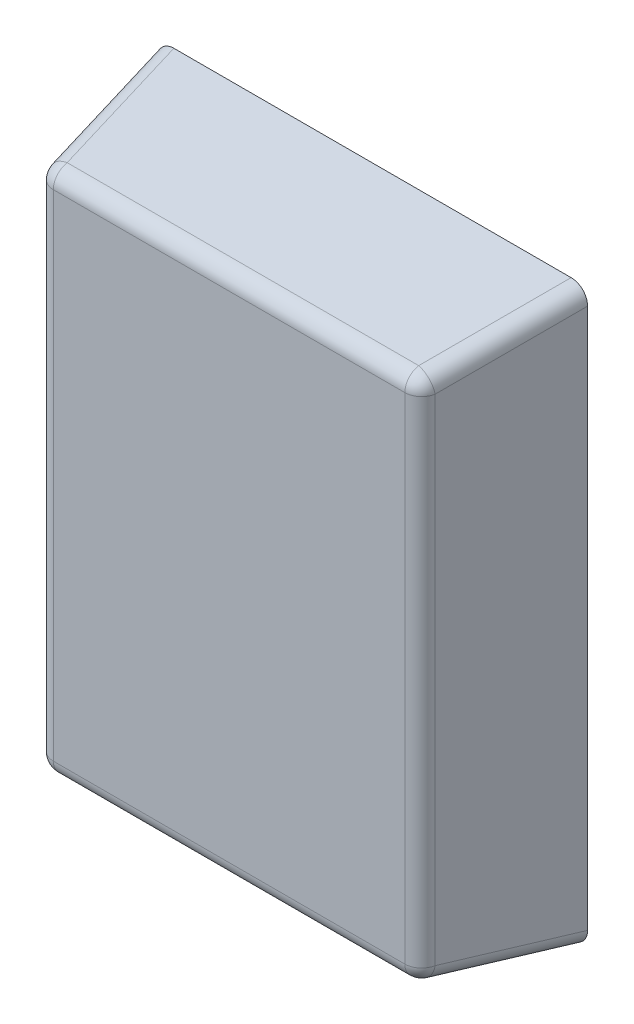
ISO-10303-21;
HEADER;
FILE_DESCRIPTION(('STEP AP214'),'2;1');
FILE_NAME('part.step','',(''),(''),'','','');
FILE_SCHEMA(('AUTOMOTIVE_DESIGN { 1 0 10303 214 1 1 1 1 }'));
ENDSEC;
DATA;
#1=APPLICATION_CONTEXT('core data for automotive mechanical design processes');
#2=APPLICATION_PROTOCOL_DEFINITION('international standard','automotive_design',2000,#1);
#3=PRODUCT_CONTEXT('',#1,'mechanical');
#4=PRODUCT('Part','Part','',(#3));
#5=PRODUCT_RELATED_PRODUCT_CATEGORY('part','',(#4));
#6=PRODUCT_DEFINITION_FORMATION('','',#4);
#7=PRODUCT_DEFINITION_CONTEXT('part definition',#1,'design');
#8=PRODUCT_DEFINITION('design','',#6,#7);
#9=PRODUCT_DEFINITION_SHAPE('','',#8);
#10=(LENGTH_UNIT() NAMED_UNIT(*) SI_UNIT(.MILLI.,.METRE.));
#11=(NAMED_UNIT(*) PLANE_ANGLE_UNIT() SI_UNIT($,.RADIAN.));
#12=(NAMED_UNIT(*) SI_UNIT($,.STERADIAN.) SOLID_ANGLE_UNIT());
#13=UNCERTAINTY_MEASURE_WITH_UNIT(LENGTH_MEASURE(1.E-05),#10,'distance_accuracy_value','');
#14=(GEOMETRIC_REPRESENTATION_CONTEXT(3) GLOBAL_UNCERTAINTY_ASSIGNED_CONTEXT((#13)) GLOBAL_UNIT_ASSIGNED_CONTEXT((#10,
#11,#12)) REPRESENTATION_CONTEXT('',''));
#15=CARTESIAN_POINT('',(0.,0.,0.));
#16=DIRECTION('',(0.,0.,1.));
#17=DIRECTION('',(1.,0.,0.));
#18=AXIS2_PLACEMENT_3D('',#15,#16,#17);
#19=CARTESIAN_POINT('',(-0.927464285309382,-0.641019643054923,0.245));
#20=DIRECTION('',(0.,0.,1.));
#21=DIRECTION('',(1.,0.,0.));
#22=AXIS2_PLACEMENT_3D('',#19,#20,#21);
#23=PLANE('',#22);
#24=DIRECTION('',(0.,1.,0.));
#25=VECTOR('',#24,1.);
#26=CARTESIAN_POINT('',(-0.853917601570131,-0.581022128259369,0.245));
#27=LINE('',#26,#25);
#28=CARTESIAN_POINT('',(-0.853917601570131,-0.537477929724562,0.245));
#29=VERTEX_POINT('',#28);
#30=CARTESIAN_POINT('',(-0.853917601570131,-0.744561356385284,0.245));
#31=VERTEX_POINT('',#30);
#32=EDGE_CURVE('E236',#29,#31,#27,.F.);
#33=ORIENTED_EDGE('',*,*,#32,.F.);
#34=DIRECTION('',(-1.,0.,0.));
#35=VECTOR('',#34,1.);
#36=CARTESIAN_POINT('',(-0.972464285309383,-0.537477929724562,0.245));
#37=LINE('',#36,#35);
#38=CARTESIAN_POINT('',(-1.00101096904863,-0.537477929724562,0.245));
#39=VERTEX_POINT('',#38);
#40=EDGE_CURVE('E224',#39,#29,#37,.F.);
#41=ORIENTED_EDGE('',*,*,#40,.F.);
#42=DIRECTION('',(0.,-1.,0.));
#43=VECTOR('',#42,1.);
#44=CARTESIAN_POINT('',(-1.00101096904863,-0.701017157850478,0.245));
#45=LINE('',#44,#43);
#46=CARTESIAN_POINT('',(-1.00101096904863,-0.744561356385284,0.245));
#47=VERTEX_POINT('',#46);
#48=EDGE_CURVE('E229',#47,#39,#45,.F.);
#49=ORIENTED_EDGE('',*,*,#48,.F.);
#50=DIRECTION('',(1.,0.,0.));
#51=VECTOR('',#50,1.);
#52=CARTESIAN_POINT('',(-0.882464285309382,-0.744561356385284,0.245));
#53=LINE('',#52,#51);
#54=EDGE_CURVE('E241',#31,#47,#53,.F.);
#55=ORIENTED_EDGE('',*,*,#54,.F.);
#56=EDGE_LOOP('',(#33,#41,#49,#55));
#57=FACE_BOUND('',#56,.T.);
#58=ADVANCED_FACE('F17',(#57),#23,.T.);
#59=CARTESIAN_POINT('',(-1.00101096904863,-0.701017157850478,0.238));
#60=DIRECTION('',(0.,-1.,0.));
#61=DIRECTION('',(1.,0.,0.));
#62=AXIS2_PLACEMENT_3D('',#59,#60,#61);
#63=CYLINDRICAL_SURFACE('',#62,0.007);
#64=DIRECTION('',(0.,1.,0.));
#65=VECTOR('',#64,1.);
#66=CARTESIAN_POINT('',(-1.00790462331972,-0.761014672646032,0.239215537243667));
#67=LINE('',#66,#65);
#68=CARTESIAN_POINT('',(-1.00790462331972,-0.744561356385283,0.239215537243667));
#69=VERTEX_POINT('',#68);
#70=CARTESIAN_POINT('',(-1.00790462331972,-0.537477929724562,0.239215537243668));
#71=VERTEX_POINT('',#70);
#72=EDGE_CURVE('E114',#69,#71,#67,.T.);
#73=ORIENTED_EDGE('',*,*,#72,.F.);
#74=CARTESIAN_POINT('',(-1.00101096904863,-0.744561356385283,0.238));
#75=DIRECTION('',(0.,-1.,-1.82015343698568E-13));
#76=DIRECTION('',(1.,0.,0.));
#77=AXIS2_PLACEMENT_3D('',#74,#75,#76);
#78=CIRCLE('',#77,0.007);
#79=EDGE_CURVE('E221',#47,#69,#78,.T.);
#80=ORIENTED_EDGE('',*,*,#79,.F.);
#81=ORIENTED_EDGE('',*,*,#48,.T.);
#82=CARTESIAN_POINT('',(-1.00101096904863,-0.537477929724562,0.238));
#83=DIRECTION('',(0.,-1.,0.));
#84=DIRECTION('',(1.,0.,0.));
#85=AXIS2_PLACEMENT_3D('',#82,#83,#84);
#86=CIRCLE('',#85,0.007);
#87=EDGE_CURVE('E74',#71,#39,#86,.F.);
#88=ORIENTED_EDGE('',*,*,#87,.F.);
#89=EDGE_LOOP('',(#73,#80,#81,#88));
#90=FACE_BOUND('',#89,.T.);
#91=ADVANCED_FACE('F214',(#90),#63,.T.);
#92=CARTESIAN_POINT('',(-1.00101096904863,-0.744561356385283,0.238));
#93=DIRECTION('',(1.,0.,0.));
#94=DIRECTION('',(0.,1.,0.));
#95=AXIS2_PLACEMENT_3D('',#92,#93,#94);
#96=SPHERICAL_SURFACE('',#95,0.007);
#97=ORIENTED_EDGE('',*,*,#79,.T.);
#98=CARTESIAN_POINT('',(-1.00101096904863,-0.744561356385283,0.238));
#99=DIRECTION('',(-0.171087869746035,-0.171087869746037,-0.970287525247814));
#100=DIRECTION('',(0.,0.984807753012208,-0.173648177666932));
#101=AXIS2_PLACEMENT_3D('',#98,#99,#100);
#102=CIRCLE('',#101,0.007);
#103=CARTESIAN_POINT('',(-1.00101096904863,-0.751455010656369,0.239215537243669));
#104=VERTEX_POINT('',#103);
#105=EDGE_CURVE('E20',#104,#69,#102,.T.);
#106=ORIENTED_EDGE('',*,*,#105,.F.);
#107=CARTESIAN_POINT('',(-1.00101096904863,-0.744561356385284,0.238));
#108=DIRECTION('',(1.,0.,0.));
#109=DIRECTION('',(0.,1.,0.));
#110=AXIS2_PLACEMENT_3D('',#107,#108,#109);
#111=CIRCLE('',#110,0.007);
#112=EDGE_CURVE('E223',#47,#104,#111,.T.);
#113=ORIENTED_EDGE('',*,*,#112,.F.);
#114=EDGE_LOOP('',(#97,#106,#113));
#115=FACE_BOUND('',#114,.T.);
#116=ADVANCED_FACE('F210',(#115),#96,.T.);
#117=CARTESIAN_POINT('',(-0.882464285309382,-0.744561356385284,0.238));
#118=DIRECTION('',(1.,0.,0.));
#119=DIRECTION('',(0.,1.,0.));
#120=AXIS2_PLACEMENT_3D('',#117,#118,#119);
#121=CYLINDRICAL_SURFACE('',#120,0.007);
#122=DIRECTION('',(1.,0.,0.));
#123=VECTOR('',#122,1.);
#124=CARTESIAN_POINT('',(-0.837464285309383,-0.75145501065637,0.239215537243668));
#125=LINE('',#124,#123);
#126=CARTESIAN_POINT('',(-0.853917601570131,-0.751455010656369,0.239215537243668));
#127=VERTEX_POINT('',#126);
#128=EDGE_CURVE('E146',#127,#104,#125,.F.);
#129=ORIENTED_EDGE('',*,*,#128,.F.);
#130=CARTESIAN_POINT('',(-0.853917601570131,-0.744561356385284,0.238));
#131=DIRECTION('',(1.,0.,0.));
#132=DIRECTION('',(0.,1.,0.));
#133=AXIS2_PLACEMENT_3D('',#130,#131,#132);
#134=CIRCLE('',#133,0.00699999999999995);
#135=EDGE_CURVE('E198',#31,#127,#134,.T.);
#136=ORIENTED_EDGE('',*,*,#135,.F.);
#137=ORIENTED_EDGE('',*,*,#54,.T.);
#138=ORIENTED_EDGE('',*,*,#112,.T.);
#139=EDGE_LOOP('',(#129,#136,#137,#138));
#140=FACE_BOUND('',#139,.T.);
#141=ADVANCED_FACE('F206',(#140),#121,.T.);
#142=CARTESIAN_POINT('',(-0.853917601570132,-0.744561356385284,0.238));
#143=DIRECTION('',(1.,0.,0.));
#144=DIRECTION('',(0.,1.,0.));
#145=AXIS2_PLACEMENT_3D('',#142,#143,#144);
#146=SPHERICAL_SURFACE('',#145,0.007);
#147=ORIENTED_EDGE('',*,*,#135,.T.);
#148=CARTESIAN_POINT('',(-0.853917601570132,-0.744561356385283,0.237999999999999));
#149=DIRECTION('',(0.171087869746039,-0.171087869746042,-0.970287525247812));
#150=DIRECTION('',(0.,0.984807753012207,-0.173648177666937));
#151=AXIS2_PLACEMENT_3D('',#148,#149,#150);
#152=CIRCLE('',#151,0.007);
#153=CARTESIAN_POINT('',(-0.847023947299046,-0.744561356385284,0.239215537243668));
#154=VERTEX_POINT('',#153);
#155=EDGE_CURVE('E136',#154,#127,#152,.T.);
#156=ORIENTED_EDGE('',*,*,#155,.F.);
#157=CARTESIAN_POINT('',(-0.853917601570131,-0.744561356385284,0.238));
#158=DIRECTION('',(0.,1.,0.));
#159=DIRECTION('',(-1.,0.,0.));
#160=AXIS2_PLACEMENT_3D('',#157,#158,#159);
#161=CIRCLE('',#160,0.007);
#162=EDGE_CURVE('E194',#31,#154,#161,.T.);
#163=ORIENTED_EDGE('',*,*,#162,.F.);
#164=EDGE_LOOP('',(#147,#156,#163));
#165=FACE_BOUND('',#164,.T.);
#166=ADVANCED_FACE('F203',(#165),#146,.T.);
#167=CARTESIAN_POINT('',(-0.853917601570131,-0.581022128259369,0.238));
#168=DIRECTION('',(0.,1.,0.));
#169=DIRECTION('',(-1.,0.,0.));
#170=AXIS2_PLACEMENT_3D('',#167,#168,#169);
#171=CYLINDRICAL_SURFACE('',#170,0.007);
#172=DIRECTION('',(0.,1.,0.));
#173=VECTOR('',#172,1.);
#174=CARTESIAN_POINT('',(-0.847023947299045,-0.521024613463814,0.239215537243668));
#175=LINE('',#174,#173);
#176=CARTESIAN_POINT('',(-0.847023947299046,-0.537477929724562,0.239215537243668));
#177=VERTEX_POINT('',#176);
#178=EDGE_CURVE('E137',#177,#154,#175,.F.);
#179=ORIENTED_EDGE('',*,*,#178,.F.);
#180=CARTESIAN_POINT('',(-0.853917601570131,-0.537477929724562,0.238));
#181=DIRECTION('',(0.,-1.,0.));
#182=DIRECTION('',(1.,0.,0.));
#183=AXIS2_PLACEMENT_3D('',#180,#181,#182);
#184=CIRCLE('',#183,0.007);
#185=EDGE_CURVE('E190',#29,#177,#184,.F.);
#186=ORIENTED_EDGE('',*,*,#185,.F.);
#187=ORIENTED_EDGE('',*,*,#32,.T.);
#188=ORIENTED_EDGE('',*,*,#162,.T.);
#189=EDGE_LOOP('',(#179,#186,#187,#188));
#190=FACE_BOUND('',#189,.T.);
#191=ADVANCED_FACE('F182',(#190),#171,.T.);
#192=CARTESIAN_POINT('',(-0.853917601570131,-0.537477929724562,0.238));
#193=DIRECTION('',(1.,0.,0.));
#194=DIRECTION('',(0.,1.,0.));
#195=AXIS2_PLACEMENT_3D('',#192,#193,#194);
#196=SPHERICAL_SURFACE('',#195,0.007);
#197=CARTESIAN_POINT('',(-0.853917601570131,-0.537477929724562,0.238));
#198=DIRECTION('',(-1.,0.,0.));
#199=DIRECTION('',(0.,-1.,0.));
#200=AXIS2_PLACEMENT_3D('',#197,#198,#199);
#201=CIRCLE('',#200,0.007);
#202=CARTESIAN_POINT('',(-0.853917601570131,-0.530584275453477,0.239215537243668));
#203=VERTEX_POINT('',#202);
#204=EDGE_CURVE('E193',#29,#203,#201,.T.);
#205=ORIENTED_EDGE('',*,*,#204,.F.);
#206=ORIENTED_EDGE('',*,*,#185,.T.);
#207=CARTESIAN_POINT('',(-0.853917601570132,-0.537477929724563,0.237999999999999));
#208=DIRECTION('',(0.17108786974604,0.171087869746041,-0.970287525247812));
#209=DIRECTION('',(0.,0.984807753012207,0.173648177666936));
#210=AXIS2_PLACEMENT_3D('',#207,#208,#209);
#211=CIRCLE('',#210,0.007);
#212=EDGE_CURVE('E133',#203,#177,#211,.T.);
#213=ORIENTED_EDGE('',*,*,#212,.F.);
#214=EDGE_LOOP('',(#205,#206,#213));
#215=FACE_BOUND('',#214,.T.);
#216=ADVANCED_FACE('F178',(#215),#196,.T.);
#217=CARTESIAN_POINT('',(-0.972464285309383,-0.537477929724562,0.238));
#218=DIRECTION('',(-1.,0.,0.));
#219=DIRECTION('',(0.,-1.,0.));
#220=AXIS2_PLACEMENT_3D('',#217,#218,#219);
#221=CYLINDRICAL_SURFACE('',#220,0.007);
#222=DIRECTION('',(1.,0.,0.));
#223=VECTOR('',#222,1.);
#224=CARTESIAN_POINT('',(-1.01746428530938,-0.530584275453476,0.239215537243668));
#225=LINE('',#224,#223);
#226=CARTESIAN_POINT('',(-1.00101096904863,-0.530584275453477,0.239215537243668));
#227=VERTEX_POINT('',#226);
#228=EDGE_CURVE('E134',#227,#203,#225,.T.);
#229=ORIENTED_EDGE('',*,*,#228,.F.);
#230=CARTESIAN_POINT('',(-1.00101096904863,-0.537477929724562,0.238));
#231=DIRECTION('',(1.,0.,0.));
#232=DIRECTION('',(0.,1.,0.));
#233=AXIS2_PLACEMENT_3D('',#230,#231,#232);
#234=CIRCLE('',#233,0.00699999999999995);
#235=EDGE_CURVE('E82',#39,#227,#234,.F.);
#236=ORIENTED_EDGE('',*,*,#235,.F.);
#237=ORIENTED_EDGE('',*,*,#40,.T.);
#238=ORIENTED_EDGE('',*,*,#204,.T.);
#239=EDGE_LOOP('',(#229,#236,#237,#238));
#240=FACE_BOUND('',#239,.T.);
#241=ADVANCED_FACE('F173',(#240),#221,.T.);
#242=CARTESIAN_POINT('',(-1.00101096904863,-0.537477929724562,0.238));
#243=DIRECTION('',(1.,0.,0.));
#244=DIRECTION('',(0.,1.,0.));
#245=AXIS2_PLACEMENT_3D('',#242,#243,#244);
#246=SPHERICAL_SURFACE('',#245,0.007);
#247=ORIENTED_EDGE('',*,*,#87,.T.);
#248=ORIENTED_EDGE('',*,*,#235,.T.);
#249=CARTESIAN_POINT('',(-1.00101096904864,-0.537477929724562,0.238));
#250=DIRECTION('',(-0.171087869746029,0.171087869746031,-0.970287525247816));
#251=DIRECTION('',(0.,0.984807753012209,0.173648177666926));
#252=AXIS2_PLACEMENT_3D('',#249,#250,#251);
#253=CIRCLE('',#252,0.007);
#254=EDGE_CURVE('E126',#71,#227,#253,.T.);
#255=ORIENTED_EDGE('',*,*,#254,.F.);
#256=EDGE_LOOP('',(#247,#248,#255));
#257=FACE_BOUND('',#256,.T.);
#258=ADVANCED_FACE('F169',(#257),#246,.T.);
#259=CARTESIAN_POINT('',(-1.01746428530938,-0.761014672646032,0.185));
#260=DIRECTION('',(-0.984807753012208,0.,0.173648177666928));
#261=DIRECTION('',(0.173648177666928,0.,0.984807753012208));
#262=AXIS2_PLACEMENT_3D('',#259,#260,#261);
#263=PLANE('',#262);
#264=DIRECTION('',(-0.171087869746035,-0.171087869746037,-0.970287525247814));
#265=VECTOR('',#264,1.);
#266=CARTESIAN_POINT('',(-1.0150316745458,-0.751688407611361,0.198796021197729));
#267=LINE('',#266,#265);
#268=CARTESIAN_POINT('',(-1.01746428530938,-0.754121018374946,0.185));
#269=VERTEX_POINT('',#268);
#270=EDGE_CURVE('E104',#69,#269,#267,.T.);
#271=ORIENTED_EDGE('',*,*,#270,.F.);
#272=ORIENTED_EDGE('',*,*,#72,.T.);
#273=DIRECTION('',(-0.171087869746033,0.171087869746029,-0.970287525247815));
#274=VECTOR('',#273,1.);
#275=CARTESIAN_POINT('',(-1.00790462331972,-0.537477929724562,0.239215537243667));
#276=LINE('',#275,#274);
#277=CARTESIAN_POINT('',(-1.01746428530938,-0.527918267734899,0.185));
#278=VERTEX_POINT('',#277);
#279=EDGE_CURVE('E111',#71,#278,#276,.T.);
#280=ORIENTED_EDGE('',*,*,#279,.T.);
#281=DIRECTION('',(0.,1.,0.));
#282=VECTOR('',#281,1.);
#283=CARTESIAN_POINT('',(-1.01746428530938,-0.641019643054923,0.185));
#284=LINE('',#283,#282);
#285=EDGE_CURVE('E113',#278,#269,#284,.F.);
#286=ORIENTED_EDGE('',*,*,#285,.T.);
#287=EDGE_LOOP('',(#271,#272,#280,#286));
#288=FACE_BOUND('',#287,.T.);
#289=ADVANCED_FACE('F112',(#288),#263,.T.);
#290=CARTESIAN_POINT('',(-1.00813802027471,-0.751688407611361,0.197580483954061));
#291=DIRECTION('',(-0.171087869746035,-0.171087869746037,-0.970287525247814));
#292=DIRECTION('',(0.,0.984807753012208,-0.173648177666932));
#293=AXIS2_PLACEMENT_3D('',#290,#291,#292);
#294=CYLINDRICAL_SURFACE('',#293,0.007);
#295=DIRECTION('',(-0.171087869746152,-0.171087869746034,-0.970287525247793));
#296=VECTOR('',#295,1.);
#297=CARTESIAN_POINT('',(-1.00101096904863,-0.751455010656369,0.239215537243668));
#298=LINE('',#297,#296);
#299=CARTESIAN_POINT('',(-1.0105706310383,-0.761014672646032,0.185));
#300=VERTEX_POINT('',#299);
#301=EDGE_CURVE('E151',#104,#300,#298,.T.);
#302=ORIENTED_EDGE('',*,*,#301,.F.);
#303=ORIENTED_EDGE('',*,*,#105,.T.);
#304=ORIENTED_EDGE('',*,*,#270,.T.);
#305=CARTESIAN_POINT('',(-1.01035629902618,-0.753906686362832,0.185));
#306=DIRECTION('',(0.,0.,1.));
#307=DIRECTION('',(-0.707106781186543,-0.707106781186552,0.));
#308=AXIS2_PLACEMENT_3D('',#305,#306,#307);
#309=ELLIPSE('',#308,0.00721435638184896,0.007);
#310=EDGE_CURVE('E120',#269,#300,#309,.T.);
#311=ORIENTED_EDGE('',*,*,#310,.T.);
#312=EDGE_LOOP('',(#302,#303,#304,#311));
#313=FACE_BOUND('',#312,.T.);
#314=ADVANCED_FACE('F279',(#313),#294,.T.);
#315=CARTESIAN_POINT('',(-0.837464285309383,-0.761014672646033,0.185));
#316=DIRECTION('',(0.,-0.984807753012208,0.173648177666931));
#317=DIRECTION('',(0.,-0.173648177666931,-0.984807753012208));
#318=AXIS2_PLACEMENT_3D('',#315,#316,#317);
#319=PLANE('',#318);
#320=DIRECTION('',(0.171087869746039,-0.171087869746042,-0.970287525247812));
#321=VECTOR('',#320,1.);
#322=CARTESIAN_POINT('',(-0.847668536630148,-0.757704075596352,0.203775328859929));
#323=LINE('',#322,#321);
#324=CARTESIAN_POINT('',(-0.844357939580468,-0.761014672646032,0.185));
#325=VERTEX_POINT('',#324);
#326=EDGE_CURVE('E138',#127,#325,#323,.T.);
#327=ORIENTED_EDGE('',*,*,#326,.F.);
#328=ORIENTED_EDGE('',*,*,#128,.T.);
#329=ORIENTED_EDGE('',*,*,#301,.T.);
#330=DIRECTION('',(1.,0.,0.));
#331=VECTOR('',#330,1.);
#332=CARTESIAN_POINT('',(-0.927464285309382,-0.761014672646032,0.185));
#333=LINE('',#332,#331);
#334=EDGE_CURVE('E156',#300,#325,#333,.T.);
#335=ORIENTED_EDGE('',*,*,#334,.T.);
#336=EDGE_LOOP('',(#327,#328,#329,#335));
#337=FACE_BOUND('',#336,.T.);
#338=ADVANCED_FACE('F271',(#337),#319,.T.);
#339=CARTESIAN_POINT('',(-0.847668536630148,-0.750810421325267,0.202559791616261));
#340=DIRECTION('',(0.171087869746039,-0.171087869746042,-0.970287525247812));
#341=DIRECTION('',(0.,0.984807753012207,-0.173648177666937));
#342=AXIS2_PLACEMENT_3D('',#339,#340,#341);
#343=CYLINDRICAL_SURFACE('',#342,0.007);
#344=DIRECTION('',(0.171087869746035,-0.171087869746032,-0.970287525247814));
#345=VECTOR('',#344,1.);
#346=CARTESIAN_POINT('',(-0.847023947299046,-0.744561356385284,0.239215537243668));
#347=LINE('',#346,#345);
#348=CARTESIAN_POINT('',(-0.837464285309383,-0.754121018374947,0.185));
#349=VERTEX_POINT('',#348);
#350=EDGE_CURVE('E144',#154,#349,#347,.T.);
#351=ORIENTED_EDGE('',*,*,#350,.F.);
#352=ORIENTED_EDGE('',*,*,#155,.T.);
#353=ORIENTED_EDGE('',*,*,#326,.T.);
#354=CARTESIAN_POINT('',(-0.844572271592583,-0.753906686362832,0.185));
#355=DIRECTION('',(0.,0.,1.));
#356=DIRECTION('',(0.707106781186541,-0.707106781186554,0.));
#357=AXIS2_PLACEMENT_3D('',#354,#355,#356);
#358=ELLIPSE('',#357,0.00721435638184897,0.007);
#359=EDGE_CURVE('E159',#325,#349,#358,.T.);
#360=ORIENTED_EDGE('',*,*,#359,.T.);
#361=EDGE_LOOP('',(#351,#352,#353,#360));
#362=FACE_BOUND('',#361,.T.);
#363=ADVANCED_FACE('F269',(#362),#343,.T.);
#364=CARTESIAN_POINT('',(-0.837464285309382,-0.521024613463814,0.185));
#365=DIRECTION('',(0.984807753012208,0.,0.173648177666929));
#366=DIRECTION('',(0.173648177666929,0.,-0.984807753012208));
#367=AXIS2_PLACEMENT_3D('',#364,#365,#366);
#368=PLANE('',#367);
#369=ORIENTED_EDGE('',*,*,#350,.T.);
#370=DIRECTION('',(0.,1.,0.));
#371=VECTOR('',#370,1.);
#372=CARTESIAN_POINT('',(-0.837464285309383,-0.641019643054923,0.185));
#373=LINE('',#372,#371);
#374=CARTESIAN_POINT('',(-0.837464285309383,-0.527918267734899,0.185));
#375=VERTEX_POINT('',#374);
#376=EDGE_CURVE('E248',#349,#375,#373,.T.);
#377=ORIENTED_EDGE('',*,*,#376,.T.);
#378=DIRECTION('',(0.17108786974604,0.171087869746041,-0.970287525247812));
#379=VECTOR('',#378,1.);
#380=CARTESIAN_POINT('',(-0.839896896072969,-0.530350878498484,0.19879602119773));
#381=LINE('',#380,#379);
#382=EDGE_CURVE('E135',#177,#375,#381,.T.);
#383=ORIENTED_EDGE('',*,*,#382,.F.);
#384=ORIENTED_EDGE('',*,*,#178,.T.);
#385=EDGE_LOOP('',(#369,#377,#383,#384));
#386=FACE_BOUND('',#385,.T.);
#387=ADVANCED_FACE('F264',(#386),#368,.T.);
#388=CARTESIAN_POINT('',(-0.846790550344054,-0.530350878498485,0.197580483954061));
#389=DIRECTION('',(0.17108786974604,0.171087869746041,-0.970287525247812));
#390=DIRECTION('',(0.,0.984807753012207,0.173648177666936));
#391=AXIS2_PLACEMENT_3D('',#388,#389,#390);
#392=CYLINDRICAL_SURFACE('',#391,0.007);
#393=DIRECTION('',(0.171087869746032,0.171087869746036,-0.970287525247815));
#394=VECTOR('',#393,1.);
#395=CARTESIAN_POINT('',(-0.853917601570131,-0.530584275453476,0.239215537243668));
#396=LINE('',#395,#394);
#397=CARTESIAN_POINT('',(-0.844357939580468,-0.521024613463814,0.185));
#398=VERTEX_POINT('',#397);
#399=EDGE_CURVE('E132',#203,#398,#396,.T.);
#400=ORIENTED_EDGE('',*,*,#399,.F.);
#401=ORIENTED_EDGE('',*,*,#212,.T.);
#402=ORIENTED_EDGE('',*,*,#382,.T.);
#403=CARTESIAN_POINT('',(-0.844572271592583,-0.528132599747014,0.185));
#404=DIRECTION('',(0.,0.,1.));
#405=DIRECTION('',(0.707106781186545,0.70710678118655,0.));
#406=AXIS2_PLACEMENT_3D('',#403,#404,#405);
#407=ELLIPSE('',#406,0.00721435638184897,0.007);
#408=EDGE_CURVE('E26',#375,#398,#407,.T.);
#409=ORIENTED_EDGE('',*,*,#408,.T.);
#410=EDGE_LOOP('',(#400,#401,#402,#409));
#411=FACE_BOUND('',#410,.T.);
#412=ADVANCED_FACE('F263',(#411),#392,.T.);
#413=CARTESIAN_POINT('',(-1.01746428530938,-0.521024613463813,0.185));
#414=DIRECTION('',(0.,0.984807753012208,0.17364817766693));
#415=DIRECTION('',(0.,-0.17364817766693,0.984807753012208));
#416=AXIS2_PLACEMENT_3D('',#413,#414,#415);
#417=PLANE('',#416);
#418=ORIENTED_EDGE('',*,*,#399,.T.);
#419=DIRECTION('',(1.,0.,0.));
#420=VECTOR('',#419,1.);
#421=CARTESIAN_POINT('',(-0.927464285309382,-0.521024613463814,0.185));
#422=LINE('',#421,#420);
#423=CARTESIAN_POINT('',(-1.0105706310383,-0.521024613463813,0.185));
#424=VERTEX_POINT('',#423);
#425=EDGE_CURVE('E11',#398,#424,#422,.F.);
#426=ORIENTED_EDGE('',*,*,#425,.T.);
#427=DIRECTION('',(-0.171087869746027,0.171087869746035,-0.970287525247815));
#428=VECTOR('',#427,1.);
#429=CARTESIAN_POINT('',(-1.00101096904864,-0.530584275453477,0.239215537243669));
#430=LINE('',#429,#428);
#431=EDGE_CURVE('E124',#227,#424,#430,.T.);
#432=ORIENTED_EDGE('',*,*,#431,.F.);
#433=ORIENTED_EDGE('',*,*,#228,.T.);
#434=EDGE_LOOP('',(#418,#426,#432,#433));
#435=FACE_BOUND('',#434,.T.);
#436=ADVANCED_FACE('F259',(#435),#417,.T.);
#437=CARTESIAN_POINT('',(-1.00726003398862,-0.531228864784579,0.202559791616261));
#438=DIRECTION('',(-0.171087869746029,0.171087869746031,-0.970287525247816));
#439=DIRECTION('',(0.,0.984807753012209,0.173648177666926));
#440=AXIS2_PLACEMENT_3D('',#437,#438,#439);
#441=CYLINDRICAL_SURFACE('',#440,0.007);
#442=ORIENTED_EDGE('',*,*,#431,.T.);
#443=CARTESIAN_POINT('',(-1.01035629902618,-0.528132599747014,0.185));
#444=DIRECTION('',(0.,0.,1.));
#445=DIRECTION('',(-0.707106781186543,0.707106781186552,0.));
#446=AXIS2_PLACEMENT_3D('',#443,#444,#445);
#447=ELLIPSE('',#446,0.00721435638184894,0.007);
#448=EDGE_CURVE('E35',#424,#278,#447,.T.);
#449=ORIENTED_EDGE('',*,*,#448,.T.);
#450=ORIENTED_EDGE('',*,*,#279,.F.);
#451=ORIENTED_EDGE('',*,*,#254,.T.);
#452=EDGE_LOOP('',(#442,#449,#450,#451));
#453=FACE_BOUND('',#452,.T.);
#454=ADVANCED_FACE('F122',(#453),#441,.T.);
#455=CARTESIAN_POINT('',(-0.927464285309382,-0.641019643054923,0.185));
#456=DIRECTION('',(0.,0.,1.));
#457=DIRECTION('',(1.,0.,0.));
#458=AXIS2_PLACEMENT_3D('',#455,#456,#457);
#459=PLANE('',#458);
#460=ORIENTED_EDGE('',*,*,#425,.F.);
#461=ORIENTED_EDGE('',*,*,#408,.F.);
#462=ORIENTED_EDGE('',*,*,#376,.F.);
#463=ORIENTED_EDGE('',*,*,#359,.F.);
#464=ORIENTED_EDGE('',*,*,#334,.F.);
#465=ORIENTED_EDGE('',*,*,#310,.F.);
#466=ORIENTED_EDGE('',*,*,#285,.F.);
#467=ORIENTED_EDGE('',*,*,#448,.F.);
#468=EDGE_LOOP('',(#460,#461,#462,#463,#464,#465,#466,#467));
#469=FACE_BOUND('',#468,.T.);
#470=ADVANCED_FACE('F118',(#469),#459,.F.);
#471=CLOSED_SHELL('',(#58,#91,#116,#141,#166,#191,#216,#241,#258,#289,#314,#338,#363,#387,#412,
#436,#454,#470));
#472=MANIFOLD_SOLID_BREP('B1',#471);
#473=ADVANCED_BREP_SHAPE_REPRESENTATION('',(#18,#472),#14);
#474=SHAPE_DEFINITION_REPRESENTATION(#9,#473);
ENDSEC;
END-ISO-10303-21;
